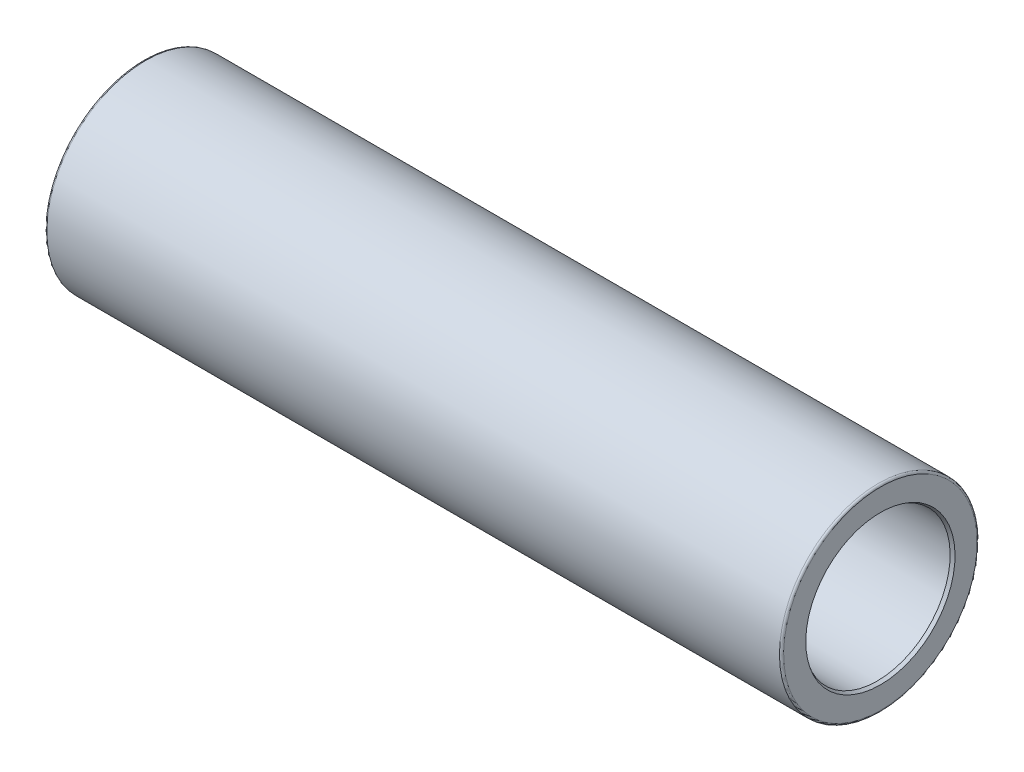
ISO-10303-21;
HEADER;
FILE_DESCRIPTION(('STEP AP214'),'2;1');
FILE_NAME('part.step','',(''),(''),'','','');
FILE_SCHEMA(('AUTOMOTIVE_DESIGN { 1 0 10303 214 1 1 1 1 }'));
ENDSEC;
DATA;
#1=APPLICATION_CONTEXT('core data for automotive mechanical design processes');
#2=APPLICATION_PROTOCOL_DEFINITION('international standard','automotive_design',2000,#1);
#3=PRODUCT_CONTEXT('',#1,'mechanical');
#4=PRODUCT('Part','Part','',(#3));
#5=PRODUCT_RELATED_PRODUCT_CATEGORY('part','',(#4));
#6=PRODUCT_DEFINITION_FORMATION('','',#4);
#7=PRODUCT_DEFINITION_CONTEXT('part definition',#1,'design');
#8=PRODUCT_DEFINITION('design','',#6,#7);
#9=PRODUCT_DEFINITION_SHAPE('','',#8);
#10=(LENGTH_UNIT() NAMED_UNIT(*) SI_UNIT(.MILLI.,.METRE.));
#11=(NAMED_UNIT(*) PLANE_ANGLE_UNIT() SI_UNIT($,.RADIAN.));
#12=(NAMED_UNIT(*) SI_UNIT($,.STERADIAN.) SOLID_ANGLE_UNIT());
#13=UNCERTAINTY_MEASURE_WITH_UNIT(LENGTH_MEASURE(1.E-05),#10,'distance_accuracy_value','');
#14=(GEOMETRIC_REPRESENTATION_CONTEXT(3) GLOBAL_UNCERTAINTY_ASSIGNED_CONTEXT((#13)) GLOBAL_UNIT_ASSIGNED_CONTEXT((#10,
#11,#12)) REPRESENTATION_CONTEXT('',''));
#15=CARTESIAN_POINT('',(0.,0.,0.));
#16=DIRECTION('',(0.,0.,1.));
#17=DIRECTION('',(1.,0.,0.));
#18=AXIS2_PLACEMENT_3D('',#15,#16,#17);
#19=CARTESIAN_POINT('',(-177.,0.,0.));
#20=DIRECTION('',(-1.,0.,0.));
#21=DIRECTION('',(0.,-1.,0.));
#22=AXIS2_PLACEMENT_3D('',#19,#20,#21);
#23=CYLINDRICAL_SURFACE('',#22,35.);
#24=CARTESIAN_POINT('',(-110.962610505505,0.,0.));
#25=DIRECTION('',(-1.,0.,0.));
#26=DIRECTION('',(0.,-1.,0.));
#27=AXIS2_PLACEMENT_3D('',#24,#25,#26);
#28=CIRCLE('',#27,35.);
#29=CARTESIAN_POINT('',(-110.962610505505,-35.,0.));
#30=VERTEX_POINT('',#29);
#31=EDGE_CURVE('E10',#30,#30,#28,.T.);
#32=ORIENTED_EDGE('',*,*,#31,.F.);
#33=EDGE_LOOP('',(#32));
#34=FACE_BOUND('',#33,.T.);
#35=CARTESIAN_POINT('',(-175.5,0.,0.));
#36=DIRECTION('',(-1.,0.,0.));
#37=DIRECTION('',(0.,-1.,0.));
#38=AXIS2_PLACEMENT_3D('',#35,#36,#37);
#39=CIRCLE('',#38,35.0000000000001);
#40=CARTESIAN_POINT('',(-175.5,-35.0000000000001,0.));
#41=VERTEX_POINT('',#40);
#42=EDGE_CURVE('E110',#41,#41,#39,.T.);
#43=ORIENTED_EDGE('',*,*,#42,.T.);
#44=EDGE_LOOP('',(#43));
#45=FACE_BOUND('',#44,.T.);
#46=ADVANCED_FACE('F37',(#34,#45),#23,.F.);
#47=CARTESIAN_POINT('',(-177.,35.,0.));
#48=DIRECTION('',(-1.,0.,0.));
#49=DIRECTION('',(0.,-1.,0.));
#50=AXIS2_PLACEMENT_3D('',#47,#48,#49);
#51=PLANE('',#50);
#52=CARTESIAN_POINT('',(-177.,0.,0.));
#53=DIRECTION('',(-1.,0.,0.));
#54=DIRECTION('',(0.,-1.,0.));
#55=AXIS2_PLACEMENT_3D('',#52,#53,#54);
#56=CIRCLE('',#55,46.5);
#57=CARTESIAN_POINT('',(-177.,-46.5,0.));
#58=VERTEX_POINT('',#57);
#59=EDGE_CURVE('E101',#58,#58,#56,.T.);
#60=ORIENTED_EDGE('',*,*,#59,.T.);
#61=EDGE_LOOP('',(#60));
#62=FACE_BOUND('',#61,.T.);
#63=CARTESIAN_POINT('',(-177.,0.,0.));
#64=DIRECTION('',(-1.,0.,0.));
#65=DIRECTION('',(0.,-1.,0.));
#66=AXIS2_PLACEMENT_3D('',#63,#64,#65);
#67=CIRCLE('',#66,35.8660254037845);
#68=CARTESIAN_POINT('',(-177.,-35.8660254037845,0.));
#69=VERTEX_POINT('',#68);
#70=EDGE_CURVE('E113',#69,#69,#67,.T.);
#71=ORIENTED_EDGE('',*,*,#70,.F.);
#72=EDGE_LOOP('',(#71));
#73=FACE_BOUND('',#72,.T.);
#74=ADVANCED_FACE('F120',(#62,#73),#51,.T.);
#75=CARTESIAN_POINT('',(-177.,0.,0.));
#76=DIRECTION('',(-1.,0.,0.));
#77=DIRECTION('',(0.,-1.,0.));
#78=AXIS2_PLACEMENT_3D('',#75,#76,#77);
#79=CYLINDRICAL_SURFACE('',#78,35.);
#80=CARTESIAN_POINT('',(110.962610505505,0.,0.));
#81=DIRECTION('',(-1.,0.,0.));
#82=DIRECTION('',(0.,-1.,0.));
#83=AXIS2_PLACEMENT_3D('',#80,#81,#82);
#84=CIRCLE('',#83,35.);
#85=CARTESIAN_POINT('',(110.962610505505,-35.,0.));
#86=VERTEX_POINT('',#85);
#87=EDGE_CURVE('E89',#86,#86,#84,.T.);
#88=ORIENTED_EDGE('',*,*,#87,.T.);
#89=EDGE_LOOP('',(#88));
#90=FACE_BOUND('',#89,.T.);
#91=CARTESIAN_POINT('',(175.5,0.,0.));
#92=DIRECTION('',(-1.,0.,0.));
#93=DIRECTION('',(0.,-1.,0.));
#94=AXIS2_PLACEMENT_3D('',#91,#92,#93);
#95=CIRCLE('',#94,35.);
#96=CARTESIAN_POINT('',(175.5,-35.,0.));
#97=VERTEX_POINT('',#96);
#98=EDGE_CURVE('E107',#97,#97,#95,.T.);
#99=ORIENTED_EDGE('',*,*,#98,.F.);
#100=EDGE_LOOP('',(#99));
#101=FACE_BOUND('',#100,.T.);
#102=ADVANCED_FACE('F122',(#90,#101),#79,.F.);
#103=CARTESIAN_POINT('',(177.,35.,0.));
#104=DIRECTION('',(-1.,0.,0.));
#105=DIRECTION('',(0.,-1.,0.));
#106=AXIS2_PLACEMENT_3D('',#103,#104,#105);
#107=PLANE('',#106);
#108=CARTESIAN_POINT('',(177.,0.,0.));
#109=DIRECTION('',(-1.,0.,0.));
#110=DIRECTION('',(0.,-1.,0.));
#111=AXIS2_PLACEMENT_3D('',#108,#109,#110);
#112=CIRCLE('',#111,46.5);
#113=CARTESIAN_POINT('',(177.,-46.5,0.));
#114=VERTEX_POINT('',#113);
#115=EDGE_CURVE('E92',#114,#114,#112,.T.);
#116=ORIENTED_EDGE('',*,*,#115,.F.);
#117=EDGE_LOOP('',(#116));
#118=FACE_BOUND('',#117,.T.);
#119=CARTESIAN_POINT('',(177.,0.,0.));
#120=DIRECTION('',(-1.,0.,0.));
#121=DIRECTION('',(0.,-1.,0.));
#122=AXIS2_PLACEMENT_3D('',#119,#120,#121);
#123=CIRCLE('',#122,35.8660254037845);
#124=CARTESIAN_POINT('',(177.,-35.8660254037844,0.));
#125=VERTEX_POINT('',#124);
#126=EDGE_CURVE('E104',#125,#125,#123,.T.);
#127=ORIENTED_EDGE('',*,*,#126,.T.);
#128=EDGE_LOOP('',(#127));
#129=FACE_BOUND('',#128,.T.);
#130=ADVANCED_FACE('F129',(#118,#129),#107,.F.);
#131=CARTESIAN_POINT('',(-110.962610505505,0.,0.));
#132=DIRECTION('',(1.,0.,0.));
#133=DIRECTION('',(0.,1.,0.));
#134=AXIS2_PLACEMENT_3D('',#131,#132,#133);
#135=CONICAL_SURFACE('',#134,35.,0.471238898038471);
#136=CARTESIAN_POINT('',(-109.,0.,0.));
#137=DIRECTION('',(-1.,0.,0.));
#138=DIRECTION('',(0.,-1.,0.));
#139=AXIS2_PLACEMENT_3D('',#136,#137,#138);
#140=CIRCLE('',#139,36.);
#141=CARTESIAN_POINT('',(-109.,-36.,0.));
#142=VERTEX_POINT('',#141);
#143=EDGE_CURVE('E43',#142,#142,#140,.T.);
#144=ORIENTED_EDGE('',*,*,#143,.F.);
#145=EDGE_LOOP('',(#144));
#146=FACE_BOUND('',#145,.T.);
#147=ORIENTED_EDGE('',*,*,#31,.T.);
#148=EDGE_LOOP('',(#147));
#149=FACE_BOUND('',#148,.T.);
#150=ADVANCED_FACE('F151',(#146,#149),#135,.F.);
#151=CARTESIAN_POINT('',(-177.,0.,0.));
#152=DIRECTION('',(-1.,0.,0.));
#153=DIRECTION('',(0.,-1.,0.));
#154=AXIS2_PLACEMENT_3D('',#151,#152,#153);
#155=CYLINDRICAL_SURFACE('',#154,36.);
#156=CARTESIAN_POINT('',(-107.,0.,0.));
#157=DIRECTION('',(-1.,0.,0.));
#158=DIRECTION('',(0.,-1.,0.));
#159=AXIS2_PLACEMENT_3D('',#156,#157,#158);
#160=CIRCLE('',#159,36.);
#161=CARTESIAN_POINT('',(-107.,-36.,0.));
#162=VERTEX_POINT('',#161);
#163=EDGE_CURVE('E47',#162,#162,#160,.T.);
#164=ORIENTED_EDGE('',*,*,#163,.F.);
#165=EDGE_LOOP('',(#164));
#166=FACE_BOUND('',#165,.T.);
#167=ORIENTED_EDGE('',*,*,#143,.T.);
#168=EDGE_LOOP('',(#167));
#169=FACE_BOUND('',#168,.T.);
#170=ADVANCED_FACE('F204',(#166,#169),#155,.F.);
#171=CARTESIAN_POINT('',(-107.,36.,0.));
#172=DIRECTION('',(1.,0.,0.));
#173=DIRECTION('',(0.,1.,0.));
#174=AXIS2_PLACEMENT_3D('',#171,#172,#173);
#175=PLANE('',#174);
#176=CARTESIAN_POINT('',(-107.,0.,0.));
#177=DIRECTION('',(-1.,0.,0.));
#178=DIRECTION('',(0.,-1.,0.));
#179=AXIS2_PLACEMENT_3D('',#176,#177,#178);
#180=CIRCLE('',#179,34.);
#181=CARTESIAN_POINT('',(-107.,-34.,0.));
#182=VERTEX_POINT('',#181);
#183=EDGE_CURVE('E51',#182,#182,#180,.T.);
#184=ORIENTED_EDGE('',*,*,#183,.F.);
#185=EDGE_LOOP('',(#184));
#186=FACE_BOUND('',#185,.T.);
#187=ORIENTED_EDGE('',*,*,#163,.T.);
#188=EDGE_LOOP('',(#187));
#189=FACE_BOUND('',#188,.T.);
#190=ADVANCED_FACE('F200',(#186,#189),#175,.F.);
#191=CARTESIAN_POINT('',(-177.,0.,0.));
#192=DIRECTION('',(-1.,0.,0.));
#193=DIRECTION('',(0.,-1.,0.));
#194=AXIS2_PLACEMENT_3D('',#191,#192,#193);
#195=CYLINDRICAL_SURFACE('',#194,34.);
#196=CARTESIAN_POINT('',(-97.1763269807085,0.,0.));
#197=DIRECTION('',(-1.,0.,0.));
#198=DIRECTION('',(0.,-1.,0.));
#199=AXIS2_PLACEMENT_3D('',#196,#197,#198);
#200=CIRCLE('',#199,34.);
#201=CARTESIAN_POINT('',(-97.1763269807085,-34.,0.));
#202=VERTEX_POINT('',#201);
#203=EDGE_CURVE('E56',#202,#202,#200,.T.);
#204=ORIENTED_EDGE('',*,*,#203,.F.);
#205=EDGE_LOOP('',(#204));
#206=FACE_BOUND('',#205,.T.);
#207=ORIENTED_EDGE('',*,*,#183,.T.);
#208=EDGE_LOOP('',(#207));
#209=FACE_BOUND('',#208,.T.);
#210=ADVANCED_FACE('F196',(#206,#209),#195,.F.);
#211=CARTESIAN_POINT('',(-97.1763269807085,0.,0.));
#212=DIRECTION('',(-1.,0.,0.));
#213=DIRECTION('',(0.,-1.,0.));
#214=AXIS2_PLACEMENT_3D('',#211,#212,#213);
#215=TOROIDAL_SURFACE('',#214,35.,1.);
#216=CARTESIAN_POINT('',(-96.8343068373828,0.,0.));
#217=DIRECTION('',(-1.,0.,0.));
#218=DIRECTION('',(0.,-1.,0.));
#219=AXIS2_PLACEMENT_3D('',#216,#217,#218);
#220=CIRCLE('',#219,34.0603073792141);
#221=CARTESIAN_POINT('',(-96.8343068373828,-34.0603073792141,0.));
#222=VERTEX_POINT('',#221);
#223=EDGE_CURVE('E59',#222,#222,#220,.T.);
#224=ORIENTED_EDGE('',*,*,#223,.F.);
#225=EDGE_LOOP('',(#224));
#226=FACE_BOUND('',#225,.T.);
#227=ORIENTED_EDGE('',*,*,#203,.T.);
#228=EDGE_LOOP('',(#227));
#229=FACE_BOUND('',#228,.T.);
#230=ADVANCED_FACE('F192',(#226,#229),#215,.T.);
#231=CARTESIAN_POINT('',(-96.8343068373828,0.,0.));
#232=DIRECTION('',(1.,0.,0.));
#233=DIRECTION('',(0.,1.,0.));
#234=AXIS2_PLACEMENT_3D('',#231,#232,#233);
#235=CONICAL_SURFACE('',#234,34.0603073792141,0.349065850398866);
#236=CARTESIAN_POINT('',(-87.549522194526,0.,0.));
#237=DIRECTION('',(-1.,0.,0.));
#238=DIRECTION('',(0.,-1.,0.));
#239=AXIS2_PLACEMENT_3D('',#236,#237,#238);
#240=CIRCLE('',#239,37.4396926207859);
#241=CARTESIAN_POINT('',(-87.549522194526,-37.4396926207859,0.));
#242=VERTEX_POINT('',#241);
#243=EDGE_CURVE('E62',#242,#242,#240,.T.);
#244=ORIENTED_EDGE('',*,*,#243,.F.);
#245=EDGE_LOOP('',(#244));
#246=FACE_BOUND('',#245,.T.);
#247=ORIENTED_EDGE('',*,*,#223,.T.);
#248=EDGE_LOOP('',(#247));
#249=FACE_BOUND('',#248,.T.);
#250=ADVANCED_FACE('F188',(#246,#249),#235,.F.);
#251=CARTESIAN_POINT('',(-87.2075020512004,0.,0.));
#252=DIRECTION('',(-1.,0.,0.));
#253=DIRECTION('',(0.,-1.,0.));
#254=AXIS2_PLACEMENT_3D('',#251,#252,#253);
#255=TOROIDAL_SURFACE('',#254,36.5,0.999999999999997);
#256=ORIENTED_EDGE('',*,*,#243,.T.);
#257=EDGE_LOOP('',(#256));
#258=FACE_BOUND('',#257,.T.);
#259=CARTESIAN_POINT('',(-87.2075020512004,0.,0.));
#260=DIRECTION('',(-1.,0.,0.));
#261=DIRECTION('',(0.,-1.,0.));
#262=AXIS2_PLACEMENT_3D('',#259,#260,#261);
#263=CIRCLE('',#262,37.5);
#264=CARTESIAN_POINT('',(-87.2075020512004,-37.5,0.));
#265=VERTEX_POINT('',#264);
#266=EDGE_CURVE('E65',#265,#265,#263,.T.);
#267=ORIENTED_EDGE('',*,*,#266,.F.);
#268=EDGE_LOOP('',(#267));
#269=FACE_BOUND('',#268,.T.);
#270=ADVANCED_FACE('F184',(#258,#269),#255,.F.);
#271=CARTESIAN_POINT('',(-177.,0.,0.));
#272=DIRECTION('',(-1.,0.,0.));
#273=DIRECTION('',(0.,-1.,0.));
#274=AXIS2_PLACEMENT_3D('',#271,#272,#273);
#275=CYLINDRICAL_SURFACE('',#274,37.5);
#276=CARTESIAN_POINT('',(87.2075020512004,0.,0.));
#277=DIRECTION('',(-1.,0.,0.));
#278=DIRECTION('',(0.,-1.,0.));
#279=AXIS2_PLACEMENT_3D('',#276,#277,#278);
#280=CIRCLE('',#279,37.5);
#281=CARTESIAN_POINT('',(87.2075020512004,-37.4999999999999,0.));
#282=VERTEX_POINT('',#281);
#283=EDGE_CURVE('E68',#282,#282,#280,.T.);
#284=ORIENTED_EDGE('',*,*,#283,.F.);
#285=EDGE_LOOP('',(#284));
#286=FACE_BOUND('',#285,.T.);
#287=ORIENTED_EDGE('',*,*,#266,.T.);
#288=EDGE_LOOP('',(#287));
#289=FACE_BOUND('',#288,.T.);
#290=ADVANCED_FACE('F180',(#286,#289),#275,.F.);
#291=CARTESIAN_POINT('',(87.2075020512004,0.,0.));
#292=DIRECTION('',(-1.,0.,0.));
#293=DIRECTION('',(0.,-1.,0.));
#294=AXIS2_PLACEMENT_3D('',#291,#292,#293);
#295=TOROIDAL_SURFACE('',#294,36.5,0.999999999999992);
#296=CARTESIAN_POINT('',(87.549522194526,0.,0.));
#297=DIRECTION('',(-1.,0.,0.));
#298=DIRECTION('',(0.,-1.,0.));
#299=AXIS2_PLACEMENT_3D('',#296,#297,#298);
#300=CIRCLE('',#299,37.4396926207859);
#301=CARTESIAN_POINT('',(87.549522194526,-37.4396926207858,0.));
#302=VERTEX_POINT('',#301);
#303=EDGE_CURVE('E71',#302,#302,#300,.T.);
#304=ORIENTED_EDGE('',*,*,#303,.F.);
#305=EDGE_LOOP('',(#304));
#306=FACE_BOUND('',#305,.T.);
#307=ORIENTED_EDGE('',*,*,#283,.T.);
#308=EDGE_LOOP('',(#307));
#309=FACE_BOUND('',#308,.T.);
#310=ADVANCED_FACE('F176',(#306,#309),#295,.F.);
#311=CARTESIAN_POINT('',(96.8343068373828,0.,0.));
#312=DIRECTION('',(-1.,0.,0.));
#313=DIRECTION('',(0.,-1.,0.));
#314=AXIS2_PLACEMENT_3D('',#311,#312,#313);
#315=CONICAL_SURFACE('',#314,34.0603073792141,0.349065850398866);
#316=ORIENTED_EDGE('',*,*,#303,.T.);
#317=EDGE_LOOP('',(#316));
#318=FACE_BOUND('',#317,.T.);
#319=CARTESIAN_POINT('',(96.8343068373828,0.,0.));
#320=DIRECTION('',(-1.,0.,0.));
#321=DIRECTION('',(0.,-1.,0.));
#322=AXIS2_PLACEMENT_3D('',#319,#320,#321);
#323=CIRCLE('',#322,34.0603073792141);
#324=CARTESIAN_POINT('',(96.8343068373828,-34.060307379214,0.));
#325=VERTEX_POINT('',#324);
#326=EDGE_CURVE('E74',#325,#325,#323,.T.);
#327=ORIENTED_EDGE('',*,*,#326,.F.);
#328=EDGE_LOOP('',(#327));
#329=FACE_BOUND('',#328,.T.);
#330=ADVANCED_FACE('F172',(#318,#329),#315,.F.);
#331=CARTESIAN_POINT('',(97.1763269807085,0.,0.));
#332=DIRECTION('',(-1.,0.,0.));
#333=DIRECTION('',(0.,-1.,0.));
#334=AXIS2_PLACEMENT_3D('',#331,#332,#333);
#335=TOROIDAL_SURFACE('',#334,35.,1.);
#336=ORIENTED_EDGE('',*,*,#326,.T.);
#337=EDGE_LOOP('',(#336));
#338=FACE_BOUND('',#337,.T.);
#339=CARTESIAN_POINT('',(97.1763269807085,0.,0.));
#340=DIRECTION('',(-1.,0.,0.));
#341=DIRECTION('',(0.,-1.,0.));
#342=AXIS2_PLACEMENT_3D('',#339,#340,#341);
#343=CIRCLE('',#342,34.);
#344=CARTESIAN_POINT('',(97.1763269807085,-34.,0.));
#345=VERTEX_POINT('',#344);
#346=EDGE_CURVE('E77',#345,#345,#343,.T.);
#347=ORIENTED_EDGE('',*,*,#346,.F.);
#348=EDGE_LOOP('',(#347));
#349=FACE_BOUND('',#348,.T.);
#350=ADVANCED_FACE('F168',(#338,#349),#335,.T.);
#351=CARTESIAN_POINT('',(-177.,0.,0.));
#352=DIRECTION('',(-1.,0.,0.));
#353=DIRECTION('',(0.,-1.,0.));
#354=AXIS2_PLACEMENT_3D('',#351,#352,#353);
#355=CYLINDRICAL_SURFACE('',#354,34.);
#356=CARTESIAN_POINT('',(107.,0.,0.));
#357=DIRECTION('',(-1.,0.,0.));
#358=DIRECTION('',(0.,-1.,0.));
#359=AXIS2_PLACEMENT_3D('',#356,#357,#358);
#360=CIRCLE('',#359,34.);
#361=CARTESIAN_POINT('',(107.,-34.,0.));
#362=VERTEX_POINT('',#361);
#363=EDGE_CURVE('E80',#362,#362,#360,.T.);
#364=ORIENTED_EDGE('',*,*,#363,.F.);
#365=EDGE_LOOP('',(#364));
#366=FACE_BOUND('',#365,.T.);
#367=ORIENTED_EDGE('',*,*,#346,.T.);
#368=EDGE_LOOP('',(#367));
#369=FACE_BOUND('',#368,.T.);
#370=ADVANCED_FACE('F164',(#366,#369),#355,.F.);
#371=CARTESIAN_POINT('',(107.,36.,0.));
#372=DIRECTION('',(1.,0.,0.));
#373=DIRECTION('',(0.,1.,0.));
#374=AXIS2_PLACEMENT_3D('',#371,#372,#373);
#375=PLANE('',#374);
#376=ORIENTED_EDGE('',*,*,#363,.T.);
#377=EDGE_LOOP('',(#376));
#378=FACE_BOUND('',#377,.T.);
#379=CARTESIAN_POINT('',(107.,0.,0.));
#380=DIRECTION('',(-1.,0.,0.));
#381=DIRECTION('',(0.,-1.,0.));
#382=AXIS2_PLACEMENT_3D('',#379,#380,#381);
#383=CIRCLE('',#382,36.);
#384=CARTESIAN_POINT('',(107.,-36.,0.));
#385=VERTEX_POINT('',#384);
#386=EDGE_CURVE('E83',#385,#385,#383,.T.);
#387=ORIENTED_EDGE('',*,*,#386,.F.);
#388=EDGE_LOOP('',(#387));
#389=FACE_BOUND('',#388,.T.);
#390=ADVANCED_FACE('F160',(#378,#389),#375,.T.);
#391=CARTESIAN_POINT('',(-177.,0.,0.));
#392=DIRECTION('',(-1.,0.,0.));
#393=DIRECTION('',(0.,-1.,0.));
#394=AXIS2_PLACEMENT_3D('',#391,#392,#393);
#395=CYLINDRICAL_SURFACE('',#394,36.);
#396=ORIENTED_EDGE('',*,*,#386,.T.);
#397=EDGE_LOOP('',(#396));
#398=FACE_BOUND('',#397,.T.);
#399=CARTESIAN_POINT('',(109.,0.,0.));
#400=DIRECTION('',(-1.,0.,0.));
#401=DIRECTION('',(0.,-1.,0.));
#402=AXIS2_PLACEMENT_3D('',#399,#400,#401);
#403=CIRCLE('',#402,36.);
#404=CARTESIAN_POINT('',(109.,-36.,0.));
#405=VERTEX_POINT('',#404);
#406=EDGE_CURVE('E86',#405,#405,#403,.T.);
#407=ORIENTED_EDGE('',*,*,#406,.F.);
#408=EDGE_LOOP('',(#407));
#409=FACE_BOUND('',#408,.T.);
#410=ADVANCED_FACE('F156',(#398,#409),#395,.F.);
#411=CARTESIAN_POINT('',(110.962610505505,0.,0.));
#412=DIRECTION('',(-1.,0.,0.));
#413=DIRECTION('',(0.,-1.,0.));
#414=AXIS2_PLACEMENT_3D('',#411,#412,#413);
#415=CONICAL_SURFACE('',#414,35.,0.471238898038474);
#416=ORIENTED_EDGE('',*,*,#406,.T.);
#417=EDGE_LOOP('',(#416));
#418=FACE_BOUND('',#417,.T.);
#419=ORIENTED_EDGE('',*,*,#87,.F.);
#420=EDGE_LOOP('',(#419));
#421=FACE_BOUND('',#420,.T.);
#422=ADVANCED_FACE('F148',(#418,#421),#415,.F.);
#423=CARTESIAN_POINT('',(176.,0.,0.));
#424=DIRECTION('',(-1.,0.,0.));
#425=DIRECTION('',(0.,-1.,0.));
#426=AXIS2_PLACEMENT_3D('',#423,#424,#425);
#427=TOROIDAL_SURFACE('',#426,46.5,1.);
#428=ORIENTED_EDGE('',*,*,#115,.T.);
#429=EDGE_LOOP('',(#428));
#430=FACE_BOUND('',#429,.T.);
#431=CARTESIAN_POINT('',(176.,0.,0.));
#432=DIRECTION('',(-1.,0.,0.));
#433=DIRECTION('',(0.,-1.,0.));
#434=AXIS2_PLACEMENT_3D('',#431,#432,#433);
#435=CIRCLE('',#434,47.5);
#436=CARTESIAN_POINT('',(176.,-47.5,0.));
#437=VERTEX_POINT('',#436);
#438=EDGE_CURVE('E95',#437,#437,#435,.T.);
#439=ORIENTED_EDGE('',*,*,#438,.F.);
#440=EDGE_LOOP('',(#439));
#441=FACE_BOUND('',#440,.T.);
#442=ADVANCED_FACE('F144',(#430,#441),#427,.T.);
#443=CARTESIAN_POINT('',(-177.,0.,0.));
#444=DIRECTION('',(-1.,0.,0.));
#445=DIRECTION('',(0.,-1.,0.));
#446=AXIS2_PLACEMENT_3D('',#443,#444,#445);
#447=CYLINDRICAL_SURFACE('',#446,47.5);
#448=ORIENTED_EDGE('',*,*,#438,.T.);
#449=EDGE_LOOP('',(#448));
#450=FACE_BOUND('',#449,.T.);
#451=CARTESIAN_POINT('',(-176.,0.,0.));
#452=DIRECTION('',(-1.,0.,0.));
#453=DIRECTION('',(0.,-1.,0.));
#454=AXIS2_PLACEMENT_3D('',#451,#452,#453);
#455=CIRCLE('',#454,47.5);
#456=CARTESIAN_POINT('',(-176.,-47.5,0.));
#457=VERTEX_POINT('',#456);
#458=EDGE_CURVE('E98',#457,#457,#455,.T.);
#459=ORIENTED_EDGE('',*,*,#458,.F.);
#460=EDGE_LOOP('',(#459));
#461=FACE_BOUND('',#460,.T.);
#462=ADVANCED_FACE('F140',(#450,#461),#447,.T.);
#463=CARTESIAN_POINT('',(-176.,0.,0.));
#464=DIRECTION('',(-1.,0.,0.));
#465=DIRECTION('',(0.,-1.,0.));
#466=AXIS2_PLACEMENT_3D('',#463,#464,#465);
#467=TOROIDAL_SURFACE('',#466,46.5,1.);
#468=ORIENTED_EDGE('',*,*,#59,.F.);
#469=EDGE_LOOP('',(#468));
#470=FACE_BOUND('',#469,.T.);
#471=ORIENTED_EDGE('',*,*,#458,.T.);
#472=EDGE_LOOP('',(#471));
#473=FACE_BOUND('',#472,.T.);
#474=ADVANCED_FACE('F137',(#470,#473),#467,.T.);
#475=CARTESIAN_POINT('',(177.,0.,0.));
#476=DIRECTION('',(1.,0.,0.));
#477=DIRECTION('',(0.,1.,0.));
#478=AXIS2_PLACEMENT_3D('',#475,#476,#477);
#479=CONICAL_SURFACE('',#478,35.8660254037845,0.523598775598294);
#480=ORIENTED_EDGE('',*,*,#98,.T.);
#481=EDGE_LOOP('',(#480));
#482=FACE_BOUND('',#481,.T.);
#483=ORIENTED_EDGE('',*,*,#126,.F.);
#484=EDGE_LOOP('',(#483));
#485=FACE_BOUND('',#484,.T.);
#486=ADVANCED_FACE('F135',(#482,#485),#479,.F.);
#487=CARTESIAN_POINT('',(-175.5,0.,0.));
#488=DIRECTION('',(-1.,0.,0.));
#489=DIRECTION('',(0.,-1.,0.));
#490=AXIS2_PLACEMENT_3D('',#487,#488,#489);
#491=CONICAL_SURFACE('',#490,35.0000000000001,0.523598775598294);
#492=ORIENTED_EDGE('',*,*,#70,.T.);
#493=EDGE_LOOP('',(#492));
#494=FACE_BOUND('',#493,.T.);
#495=ORIENTED_EDGE('',*,*,#42,.F.);
#496=EDGE_LOOP('',(#495));
#497=FACE_BOUND('',#496,.T.);
#498=ADVANCED_FACE('F117',(#494,#497),#491,.F.);
#499=CLOSED_SHELL('',(#46,#74,#102,#130,#150,#170,#190,#210,#230,#250,#270,#290,#310,#330,#350,
#370,#390,#410,#422,#442,#462,#474,#486,#498));
#500=MANIFOLD_SOLID_BREP('B2',#499);
#501=ADVANCED_BREP_SHAPE_REPRESENTATION('',(#18,#500),#14);
#502=SHAPE_DEFINITION_REPRESENTATION(#9,#501);
ENDSEC;
END-ISO-10303-21;
